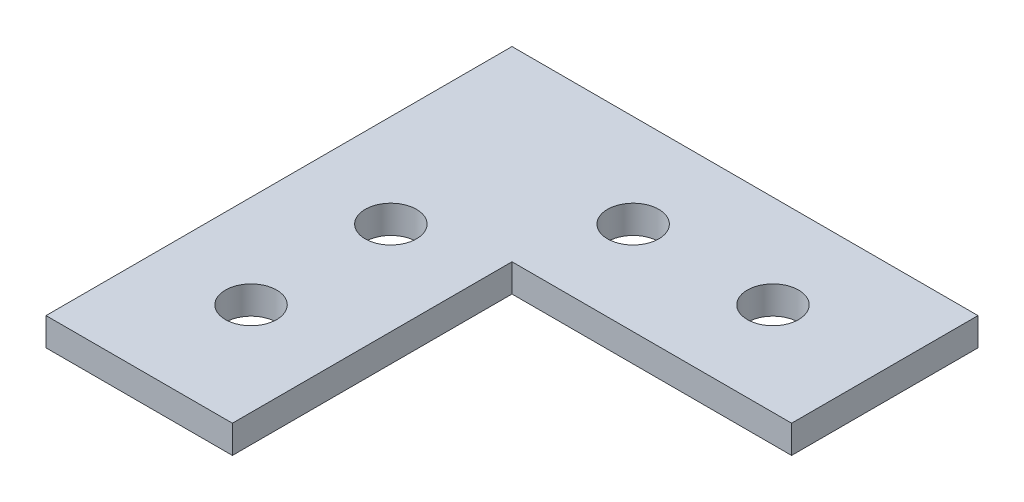
ISO-10303-21;
HEADER;
FILE_DESCRIPTION(('STEP AP214'),'2;1');
FILE_NAME('part.step','',(''),(''),'','','');
FILE_SCHEMA(('AUTOMOTIVE_DESIGN { 1 0 10303 214 1 1 1 1 }'));
ENDSEC;
DATA;
#1=APPLICATION_CONTEXT('core data for automotive mechanical design processes');
#2=APPLICATION_PROTOCOL_DEFINITION('international standard','automotive_design',2000,#1);
#3=PRODUCT_CONTEXT('',#1,'mechanical');
#4=PRODUCT('Part','Part','',(#3));
#5=PRODUCT_RELATED_PRODUCT_CATEGORY('part','',(#4));
#6=PRODUCT_DEFINITION_FORMATION('','',#4);
#7=PRODUCT_DEFINITION_CONTEXT('part definition',#1,'design');
#8=PRODUCT_DEFINITION('design','',#6,#7);
#9=PRODUCT_DEFINITION_SHAPE('','',#8);
#10=(LENGTH_UNIT() NAMED_UNIT(*) SI_UNIT(.MILLI.,.METRE.));
#11=(NAMED_UNIT(*) PLANE_ANGLE_UNIT() SI_UNIT($,.RADIAN.));
#12=(NAMED_UNIT(*) SI_UNIT($,.STERADIAN.) SOLID_ANGLE_UNIT());
#13=UNCERTAINTY_MEASURE_WITH_UNIT(LENGTH_MEASURE(1.E-05),#10,'distance_accuracy_value','');
#14=(GEOMETRIC_REPRESENTATION_CONTEXT(3) GLOBAL_UNCERTAINTY_ASSIGNED_CONTEXT((#13)) GLOBAL_UNIT_ASSIGNED_CONTEXT((#10,
#11,#12)) REPRESENTATION_CONTEXT('',''));
#15=CARTESIAN_POINT('',(0.,0.,0.));
#16=DIRECTION('',(0.,0.,1.));
#17=DIRECTION('',(1.,0.,0.));
#18=AXIS2_PLACEMENT_3D('',#15,#16,#17);
#19=CARTESIAN_POINT('',(20.,3.,0.));
#20=DIRECTION('',(1.,0.,0.));
#21=DIRECTION('',(0.,0.,-1.));
#22=AXIS2_PLACEMENT_3D('',#19,#20,#21);
#23=PLANE('',#22);
#24=DIRECTION('',(0.,0.,1.));
#25=VECTOR('',#24,1.);
#26=CARTESIAN_POINT('',(20.,0.,0.));
#27=LINE('',#26,#25);
#28=CARTESIAN_POINT('',(20.,0.,20.));
#29=VERTEX_POINT('',#28);
#30=CARTESIAN_POINT('',(20.,0.,50.));
#31=VERTEX_POINT('',#30);
#32=EDGE_CURVE('E123',#29,#31,#27,.T.);
#33=ORIENTED_EDGE('',*,*,#32,.F.);
#34=DIRECTION('',(0.,-1.,0.));
#35=VECTOR('',#34,1.);
#36=CARTESIAN_POINT('',(20.,3.,20.));
#37=LINE('',#36,#35);
#38=CARTESIAN_POINT('',(20.,3.,20.));
#39=VERTEX_POINT('',#38);
#40=EDGE_CURVE('E11',#39,#29,#37,.T.);
#41=ORIENTED_EDGE('',*,*,#40,.F.);
#42=DIRECTION('',(0.,0.,1.));
#43=VECTOR('',#42,1.);
#44=CARTESIAN_POINT('',(20.,3.,0.));
#45=LINE('',#44,#43);
#46=CARTESIAN_POINT('',(20.,3.,50.));
#47=VERTEX_POINT('',#46);
#48=EDGE_CURVE('E137',#39,#47,#45,.T.);
#49=ORIENTED_EDGE('',*,*,#48,.T.);
#50=DIRECTION('',(0.,-1.,0.));
#51=VECTOR('',#50,1.);
#52=CARTESIAN_POINT('',(20.,3.,50.));
#53=LINE('',#52,#51);
#54=EDGE_CURVE('E85',#47,#31,#53,.T.);
#55=ORIENTED_EDGE('',*,*,#54,.T.);
#56=EDGE_LOOP('',(#33,#41,#49,#55));
#57=FACE_BOUND('',#56,.T.);
#58=ADVANCED_FACE('F41',(#57),#23,.T.);
#59=CARTESIAN_POINT('',(0.,3.,20.));
#60=DIRECTION('',(0.,0.,-1.));
#61=DIRECTION('',(-1.,0.,0.));
#62=AXIS2_PLACEMENT_3D('',#59,#60,#61);
#63=PLANE('',#62);
#64=DIRECTION('',(1.,0.,0.));
#65=VECTOR('',#64,1.);
#66=CARTESIAN_POINT('',(0.,0.,20.));
#67=LINE('',#66,#65);
#68=CARTESIAN_POINT('',(50.,0.,20.));
#69=VERTEX_POINT('',#68);
#70=EDGE_CURVE('E126',#29,#69,#67,.T.);
#71=ORIENTED_EDGE('',*,*,#70,.T.);
#72=DIRECTION('',(0.,-1.,0.));
#73=VECTOR('',#72,1.);
#74=CARTESIAN_POINT('',(50.,3.,20.));
#75=LINE('',#74,#73);
#76=CARTESIAN_POINT('',(50.,3.,20.));
#77=VERTEX_POINT('',#76);
#78=EDGE_CURVE('E49',#77,#69,#75,.T.);
#79=ORIENTED_EDGE('',*,*,#78,.F.);
#80=DIRECTION('',(1.,0.,0.));
#81=VECTOR('',#80,1.);
#82=CARTESIAN_POINT('',(0.,3.,20.));
#83=LINE('',#82,#81);
#84=EDGE_CURVE('E118',#39,#77,#83,.T.);
#85=ORIENTED_EDGE('',*,*,#84,.F.);
#86=ORIENTED_EDGE('',*,*,#40,.T.);
#87=EDGE_LOOP('',(#71,#79,#85,#86));
#88=FACE_BOUND('',#87,.T.);
#89=ADVANCED_FACE('F146',(#88),#63,.F.);
#90=CARTESIAN_POINT('',(50.,3.,0.));
#91=DIRECTION('',(1.,0.,0.));
#92=DIRECTION('',(0.,0.,-1.));
#93=AXIS2_PLACEMENT_3D('',#90,#91,#92);
#94=PLANE('',#93);
#95=DIRECTION('',(0.,0.,1.));
#96=VECTOR('',#95,1.);
#97=CARTESIAN_POINT('',(50.,0.,0.));
#98=LINE('',#97,#96);
#99=CARTESIAN_POINT('',(50.,0.,0.));
#100=VERTEX_POINT('',#99);
#101=EDGE_CURVE('E130',#100,#69,#98,.T.);
#102=ORIENTED_EDGE('',*,*,#101,.F.);
#103=DIRECTION('',(0.,-1.,0.));
#104=VECTOR('',#103,1.);
#105=CARTESIAN_POINT('',(50.,3.,0.));
#106=LINE('',#105,#104);
#107=CARTESIAN_POINT('',(50.,3.,0.));
#108=VERTEX_POINT('',#107);
#109=EDGE_CURVE('E107',#108,#100,#106,.T.);
#110=ORIENTED_EDGE('',*,*,#109,.F.);
#111=DIRECTION('',(0.,0.,1.));
#112=VECTOR('',#111,1.);
#113=CARTESIAN_POINT('',(50.,3.,0.));
#114=LINE('',#113,#112);
#115=EDGE_CURVE('E116',#108,#77,#114,.T.);
#116=ORIENTED_EDGE('',*,*,#115,.T.);
#117=ORIENTED_EDGE('',*,*,#78,.T.);
#118=EDGE_LOOP('',(#102,#110,#116,#117));
#119=FACE_BOUND('',#118,.T.);
#120=ADVANCED_FACE('F143',(#119),#94,.T.);
#121=CARTESIAN_POINT('',(0.,3.,0.));
#122=DIRECTION('',(0.,0.,-1.));
#123=DIRECTION('',(-1.,0.,0.));
#124=AXIS2_PLACEMENT_3D('',#121,#122,#123);
#125=PLANE('',#124);
#126=DIRECTION('',(1.,0.,0.));
#127=VECTOR('',#126,1.);
#128=CARTESIAN_POINT('',(0.,0.,0.));
#129=LINE('',#128,#127);
#130=CARTESIAN_POINT('',(0.,0.,0.));
#131=VERTEX_POINT('',#130);
#132=EDGE_CURVE('E106',#131,#100,#129,.T.);
#133=ORIENTED_EDGE('',*,*,#132,.F.);
#134=DIRECTION('',(0.,-1.,0.));
#135=VECTOR('',#134,1.);
#136=CARTESIAN_POINT('',(0.,3.,0.));
#137=LINE('',#136,#135);
#138=CARTESIAN_POINT('',(0.,3.,0.));
#139=VERTEX_POINT('',#138);
#140=EDGE_CURVE('E100',#139,#131,#137,.T.);
#141=ORIENTED_EDGE('',*,*,#140,.F.);
#142=DIRECTION('',(1.,0.,0.));
#143=VECTOR('',#142,1.);
#144=CARTESIAN_POINT('',(0.,3.,0.));
#145=LINE('',#144,#143);
#146=EDGE_CURVE('E104',#139,#108,#145,.T.);
#147=ORIENTED_EDGE('',*,*,#146,.T.);
#148=ORIENTED_EDGE('',*,*,#109,.T.);
#149=EDGE_LOOP('',(#133,#141,#147,#148));
#150=FACE_BOUND('',#149,.T.);
#151=ADVANCED_FACE('F102',(#150),#125,.T.);
#152=CARTESIAN_POINT('',(0.,3.,0.));
#153=DIRECTION('',(1.,0.,0.));
#154=DIRECTION('',(0.,0.,-1.));
#155=AXIS2_PLACEMENT_3D('',#152,#153,#154);
#156=PLANE('',#155);
#157=DIRECTION('',(0.,0.,1.));
#158=VECTOR('',#157,1.);
#159=CARTESIAN_POINT('',(0.,0.,0.));
#160=LINE('',#159,#158);
#161=CARTESIAN_POINT('',(0.,0.,50.));
#162=VERTEX_POINT('',#161);
#163=EDGE_CURVE('E78',#131,#162,#160,.T.);
#164=ORIENTED_EDGE('',*,*,#163,.T.);
#165=DIRECTION('',(0.,-1.,0.));
#166=VECTOR('',#165,1.);
#167=CARTESIAN_POINT('',(0.,3.,50.));
#168=LINE('',#167,#166);
#169=CARTESIAN_POINT('',(0.,3.,50.));
#170=VERTEX_POINT('',#169);
#171=EDGE_CURVE('E108',#170,#162,#168,.T.);
#172=ORIENTED_EDGE('',*,*,#171,.F.);
#173=DIRECTION('',(0.,0.,1.));
#174=VECTOR('',#173,1.);
#175=CARTESIAN_POINT('',(0.,3.,0.));
#176=LINE('',#175,#174);
#177=EDGE_CURVE('E110',#139,#170,#176,.T.);
#178=ORIENTED_EDGE('',*,*,#177,.F.);
#179=ORIENTED_EDGE('',*,*,#140,.T.);
#180=EDGE_LOOP('',(#164,#172,#178,#179));
#181=FACE_BOUND('',#180,.T.);
#182=ADVANCED_FACE('F111',(#181),#156,.F.);
#183=CARTESIAN_POINT('',(0.,3.,50.));
#184=DIRECTION('',(0.,0.,-1.));
#185=DIRECTION('',(-1.,0.,0.));
#186=AXIS2_PLACEMENT_3D('',#183,#184,#185);
#187=PLANE('',#186);
#188=DIRECTION('',(1.,0.,0.));
#189=VECTOR('',#188,1.);
#190=CARTESIAN_POINT('',(0.,0.,50.));
#191=LINE('',#190,#189);
#192=EDGE_CURVE('E135',#162,#31,#191,.T.);
#193=ORIENTED_EDGE('',*,*,#192,.T.);
#194=ORIENTED_EDGE('',*,*,#54,.F.);
#195=DIRECTION('',(1.,0.,0.));
#196=VECTOR('',#195,1.);
#197=CARTESIAN_POINT('',(0.,3.,50.));
#198=LINE('',#197,#196);
#199=EDGE_CURVE('E57',#170,#47,#198,.T.);
#200=ORIENTED_EDGE('',*,*,#199,.F.);
#201=ORIENTED_EDGE('',*,*,#171,.T.);
#202=EDGE_LOOP('',(#193,#194,#200,#201));
#203=FACE_BOUND('',#202,.T.);
#204=ADVANCED_FACE('F151',(#203),#187,.F.);
#205=CARTESIAN_POINT('',(0.,3.,0.));
#206=DIRECTION('',(0.,1.,0.));
#207=DIRECTION('',(0.,0.,1.));
#208=AXIS2_PLACEMENT_3D('',#205,#206,#207);
#209=PLANE('',#208);
#210=CARTESIAN_POINT('',(10.,3.,38.));
#211=DIRECTION('',(0.,1.,0.));
#212=DIRECTION('',(0.,0.,1.));
#213=AXIS2_PLACEMENT_3D('',#210,#211,#212);
#214=CIRCLE('',#213,2.75);
#215=CARTESIAN_POINT('',(10.,3.,40.75));
#216=VERTEX_POINT('',#215);
#217=EDGE_CURVE('E167',#216,#216,#214,.T.);
#218=ORIENTED_EDGE('',*,*,#217,.F.);
#219=EDGE_LOOP('',(#218));
#220=FACE_BOUND('',#219,.T.);
#221=CARTESIAN_POINT('',(23.,3.,10.));
#222=DIRECTION('',(0.,1.,0.));
#223=DIRECTION('',(0.,0.,1.));
#224=AXIS2_PLACEMENT_3D('',#221,#222,#223);
#225=CIRCLE('',#224,2.75);
#226=CARTESIAN_POINT('',(23.,3.,12.75));
#227=VERTEX_POINT('',#226);
#228=EDGE_CURVE('E158',#227,#227,#225,.T.);
#229=ORIENTED_EDGE('',*,*,#228,.F.);
#230=EDGE_LOOP('',(#229));
#231=FACE_BOUND('',#230,.T.);
#232=CARTESIAN_POINT('',(38.,3.,10.));
#233=DIRECTION('',(0.,1.,0.));
#234=DIRECTION('',(0.,0.,1.));
#235=AXIS2_PLACEMENT_3D('',#232,#233,#234);
#236=CIRCLE('',#235,2.75);
#237=CARTESIAN_POINT('',(38.,3.,12.75));
#238=VERTEX_POINT('',#237);
#239=EDGE_CURVE('E157',#238,#238,#236,.T.);
#240=ORIENTED_EDGE('',*,*,#239,.F.);
#241=EDGE_LOOP('',(#240));
#242=FACE_BOUND('',#241,.T.);
#243=CARTESIAN_POINT('',(10.,3.,23.));
#244=DIRECTION('',(0.,1.,0.));
#245=DIRECTION('',(0.,0.,1.));
#246=AXIS2_PLACEMENT_3D('',#243,#244,#245);
#247=CIRCLE('',#246,2.75);
#248=CARTESIAN_POINT('',(10.,3.,25.75));
#249=VERTEX_POINT('',#248);
#250=EDGE_CURVE('E164',#249,#249,#247,.T.);
#251=ORIENTED_EDGE('',*,*,#250,.F.);
#252=EDGE_LOOP('',(#251));
#253=FACE_BOUND('',#252,.T.);
#254=ORIENTED_EDGE('',*,*,#48,.F.);
#255=ORIENTED_EDGE('',*,*,#84,.T.);
#256=ORIENTED_EDGE('',*,*,#115,.F.);
#257=ORIENTED_EDGE('',*,*,#146,.F.);
#258=ORIENTED_EDGE('',*,*,#177,.T.);
#259=ORIENTED_EDGE('',*,*,#199,.T.);
#260=EDGE_LOOP('',(#254,#255,#256,#257,#258,#259));
#261=FACE_BOUND('',#260,.T.);
#262=ADVANCED_FACE('F114',(#220,#231,#242,#253,#261),#209,.T.);
#263=CARTESIAN_POINT('',(0.,0.,0.));
#264=DIRECTION('',(0.,1.,0.));
#265=DIRECTION('',(0.,0.,1.));
#266=AXIS2_PLACEMENT_3D('',#263,#264,#265);
#267=PLANE('',#266);
#268=CARTESIAN_POINT('',(10.,0.,38.));
#269=DIRECTION('',(0.,1.,0.));
#270=DIRECTION('',(0.,0.,1.));
#271=AXIS2_PLACEMENT_3D('',#268,#269,#270);
#272=CIRCLE('',#271,2.75);
#273=CARTESIAN_POINT('',(10.,0.,40.75));
#274=VERTEX_POINT('',#273);
#275=EDGE_CURVE('E127',#274,#274,#272,.T.);
#276=ORIENTED_EDGE('',*,*,#275,.T.);
#277=EDGE_LOOP('',(#276));
#278=FACE_BOUND('',#277,.T.);
#279=CARTESIAN_POINT('',(23.,0.,10.));
#280=DIRECTION('',(0.,1.,0.));
#281=DIRECTION('',(0.,0.,1.));
#282=AXIS2_PLACEMENT_3D('',#279,#280,#281);
#283=CIRCLE('',#282,2.75);
#284=CARTESIAN_POINT('',(23.,0.,12.75));
#285=VERTEX_POINT('',#284);
#286=EDGE_CURVE('E168',#285,#285,#283,.T.);
#287=ORIENTED_EDGE('',*,*,#286,.T.);
#288=EDGE_LOOP('',(#287));
#289=FACE_BOUND('',#288,.T.);
#290=CARTESIAN_POINT('',(38.,0.,10.));
#291=DIRECTION('',(0.,1.,0.));
#292=DIRECTION('',(0.,0.,1.));
#293=AXIS2_PLACEMENT_3D('',#290,#291,#292);
#294=CIRCLE('',#293,2.75);
#295=CARTESIAN_POINT('',(38.,0.,12.75));
#296=VERTEX_POINT('',#295);
#297=EDGE_CURVE('E154',#296,#296,#294,.T.);
#298=ORIENTED_EDGE('',*,*,#297,.T.);
#299=EDGE_LOOP('',(#298));
#300=FACE_BOUND('',#299,.T.);
#301=CARTESIAN_POINT('',(10.,0.,23.));
#302=DIRECTION('',(0.,1.,0.));
#303=DIRECTION('',(0.,0.,1.));
#304=AXIS2_PLACEMENT_3D('',#301,#302,#303);
#305=CIRCLE('',#304,2.75);
#306=CARTESIAN_POINT('',(10.,0.,25.75));
#307=VERTEX_POINT('',#306);
#308=EDGE_CURVE('E161',#307,#307,#305,.T.);
#309=ORIENTED_EDGE('',*,*,#308,.T.);
#310=EDGE_LOOP('',(#309));
#311=FACE_BOUND('',#310,.T.);
#312=ORIENTED_EDGE('',*,*,#32,.T.);
#313=ORIENTED_EDGE('',*,*,#192,.F.);
#314=ORIENTED_EDGE('',*,*,#163,.F.);
#315=ORIENTED_EDGE('',*,*,#132,.T.);
#316=ORIENTED_EDGE('',*,*,#101,.T.);
#317=ORIENTED_EDGE('',*,*,#70,.F.);
#318=EDGE_LOOP('',(#312,#313,#314,#315,#316,#317));
#319=FACE_BOUND('',#318,.T.);
#320=ADVANCED_FACE('F148',(#278,#289,#300,#311,#319),#267,.F.);
#321=CARTESIAN_POINT('',(10.,0.,23.));
#322=DIRECTION('',(0.,1.,0.));
#323=DIRECTION('',(0.,0.,1.));
#324=AXIS2_PLACEMENT_3D('',#321,#322,#323);
#325=CYLINDRICAL_SURFACE('',#324,2.75);
#326=ORIENTED_EDGE('',*,*,#308,.F.);
#327=EDGE_LOOP('',(#326));
#328=FACE_BOUND('',#327,.T.);
#329=ORIENTED_EDGE('',*,*,#250,.T.);
#330=EDGE_LOOP('',(#329));
#331=FACE_BOUND('',#330,.T.);
#332=ADVANCED_FACE('F196',(#328,#331),#325,.F.);
#333=CARTESIAN_POINT('',(38.,0.,10.));
#334=DIRECTION('',(0.,1.,0.));
#335=DIRECTION('',(0.,0.,1.));
#336=AXIS2_PLACEMENT_3D('',#333,#334,#335);
#337=CYLINDRICAL_SURFACE('',#336,2.75);
#338=ORIENTED_EDGE('',*,*,#297,.F.);
#339=EDGE_LOOP('',(#338));
#340=FACE_BOUND('',#339,.T.);
#341=ORIENTED_EDGE('',*,*,#239,.T.);
#342=EDGE_LOOP('',(#341));
#343=FACE_BOUND('',#342,.T.);
#344=ADVANCED_FACE('F198',(#340,#343),#337,.F.);
#345=CARTESIAN_POINT('',(23.,0.,10.));
#346=DIRECTION('',(0.,1.,0.));
#347=DIRECTION('',(0.,0.,1.));
#348=AXIS2_PLACEMENT_3D('',#345,#346,#347);
#349=CYLINDRICAL_SURFACE('',#348,2.75);
#350=ORIENTED_EDGE('',*,*,#286,.F.);
#351=EDGE_LOOP('',(#350));
#352=FACE_BOUND('',#351,.T.);
#353=ORIENTED_EDGE('',*,*,#228,.T.);
#354=EDGE_LOOP('',(#353));
#355=FACE_BOUND('',#354,.T.);
#356=ADVANCED_FACE('F183',(#352,#355),#349,.F.);
#357=CARTESIAN_POINT('',(10.,0.,38.));
#358=DIRECTION('',(0.,1.,0.));
#359=DIRECTION('',(0.,0.,1.));
#360=AXIS2_PLACEMENT_3D('',#357,#358,#359);
#361=CYLINDRICAL_SURFACE('',#360,2.75);
#362=ORIENTED_EDGE('',*,*,#275,.F.);
#363=EDGE_LOOP('',(#362));
#364=FACE_BOUND('',#363,.T.);
#365=ORIENTED_EDGE('',*,*,#217,.T.);
#366=EDGE_LOOP('',(#365));
#367=FACE_BOUND('',#366,.T.);
#368=ADVANCED_FACE('F180',(#364,#367),#361,.F.);
#369=CLOSED_SHELL('',(#58,#89,#120,#151,#182,#204,#262,#320,#332,#344,#356,#368));
#370=MANIFOLD_SOLID_BREP('B2',#369);
#371=ADVANCED_BREP_SHAPE_REPRESENTATION('',(#18,#370),#14);
#372=SHAPE_DEFINITION_REPRESENTATION(#9,#371);
ENDSEC;
END-ISO-10303-21;
